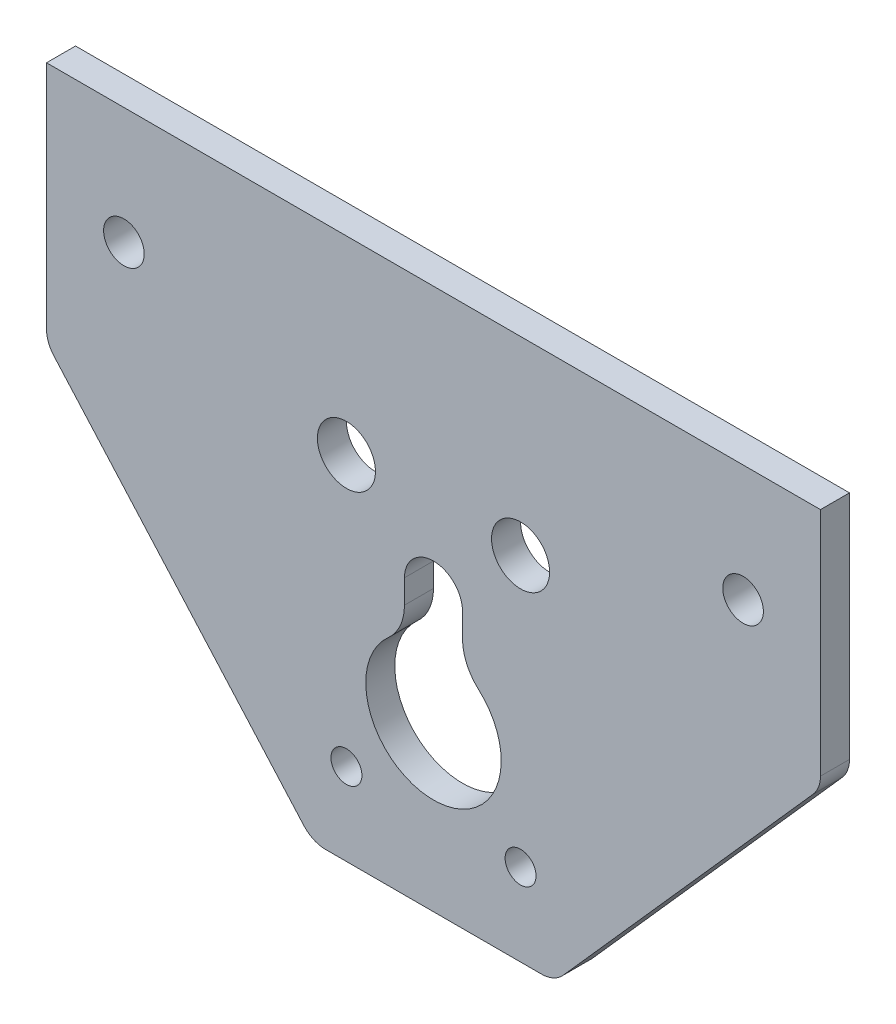
ISO-10303-21;
HEADER;
FILE_DESCRIPTION(('STEP AP214'),'2;1');
FILE_NAME('part.step','',(''),(''),'','','');
FILE_SCHEMA(('AUTOMOTIVE_DESIGN { 1 0 10303 214 1 1 1 1 }'));
ENDSEC;
DATA;
#1=APPLICATION_CONTEXT('core data for automotive mechanical design processes');
#2=APPLICATION_PROTOCOL_DEFINITION('international standard','automotive_design',2000,#1);
#3=PRODUCT_CONTEXT('',#1,'mechanical');
#4=PRODUCT('Part','Part','',(#3));
#5=PRODUCT_RELATED_PRODUCT_CATEGORY('part','',(#4));
#6=PRODUCT_DEFINITION_FORMATION('','',#4);
#7=PRODUCT_DEFINITION_CONTEXT('part definition',#1,'design');
#8=PRODUCT_DEFINITION('design','',#6,#7);
#9=PRODUCT_DEFINITION_SHAPE('','',#8);
#10=(LENGTH_UNIT() NAMED_UNIT(*) SI_UNIT(.MILLI.,.METRE.));
#11=(NAMED_UNIT(*) PLANE_ANGLE_UNIT() SI_UNIT($,.RADIAN.));
#12=(NAMED_UNIT(*) SI_UNIT($,.STERADIAN.) SOLID_ANGLE_UNIT());
#13=UNCERTAINTY_MEASURE_WITH_UNIT(LENGTH_MEASURE(1.E-05),#10,'distance_accuracy_value','');
#14=(GEOMETRIC_REPRESENTATION_CONTEXT(3) GLOBAL_UNCERTAINTY_ASSIGNED_CONTEXT((#13)) GLOBAL_UNIT_ASSIGNED_CONTEXT((#10,
#11,#12)) REPRESENTATION_CONTEXT('',''));
#15=CARTESIAN_POINT('',(0.,0.,0.));
#16=DIRECTION('',(0.,0.,1.));
#17=DIRECTION('',(1.,0.,0.));
#18=AXIS2_PLACEMENT_3D('',#15,#16,#17);
#19=CARTESIAN_POINT('',(0.,0.,3.));
#20=DIRECTION('',(0.,0.,-1.));
#21=DIRECTION('',(-1.,0.,0.));
#22=AXIS2_PLACEMENT_3D('',#19,#20,#21);
#23=PLANE('',#22);
#24=CARTESIAN_POINT('',(9.,19.4,3.));
#25=DIRECTION('',(0.,0.,1.));
#26=DIRECTION('',(1.,0.,0.));
#27=AXIS2_PLACEMENT_3D('',#24,#25,#26);
#28=CIRCLE('',#27,3.);
#29=CARTESIAN_POINT('',(12.,19.4,3.));
#30=VERTEX_POINT('',#29);
#31=EDGE_CURVE('E184',#30,#30,#28,.T.);
#32=ORIENTED_EDGE('',*,*,#31,.F.);
#33=EDGE_LOOP('',(#32));
#34=FACE_BOUND('',#33,.T.);
#35=CARTESIAN_POINT('',(-9.,19.4,3.));
#36=DIRECTION('',(0.,0.,1.));
#37=DIRECTION('',(-1.,0.,0.));
#38=AXIS2_PLACEMENT_3D('',#35,#36,#37);
#39=CIRCLE('',#38,3.);
#40=CARTESIAN_POINT('',(-12.,19.4,3.));
#41=VERTEX_POINT('',#40);
#42=EDGE_CURVE('E180',#41,#41,#39,.T.);
#43=ORIENTED_EDGE('',*,*,#42,.F.);
#44=EDGE_LOOP('',(#43));
#45=FACE_BOUND('',#44,.T.);
#46=CARTESIAN_POINT('',(31.999,26.93,3.));
#47=DIRECTION('',(0.,0.,1.));
#48=DIRECTION('',(1.,0.,0.));
#49=AXIS2_PLACEMENT_3D('',#46,#47,#48);
#50=CIRCLE('',#49,2.1);
#51=CARTESIAN_POINT('',(34.099,26.93,3.));
#52=VERTEX_POINT('',#51);
#53=EDGE_CURVE('E188',#52,#52,#50,.T.);
#54=ORIENTED_EDGE('',*,*,#53,.F.);
#55=EDGE_LOOP('',(#54));
#56=FACE_BOUND('',#55,.T.);
#57=CARTESIAN_POINT('',(-31.999,26.93,3.));
#58=DIRECTION('',(0.,0.,1.));
#59=DIRECTION('',(1.,0.,0.));
#60=AXIS2_PLACEMENT_3D('',#57,#58,#59);
#61=CIRCLE('',#60,2.1);
#62=CARTESIAN_POINT('',(-29.899,26.93,3.));
#63=VERTEX_POINT('',#62);
#64=EDGE_CURVE('E192',#63,#63,#61,.T.);
#65=ORIENTED_EDGE('',*,*,#64,.F.);
#66=EDGE_LOOP('',(#65));
#67=FACE_BOUND('',#66,.T.);
#68=DIRECTION('',(0.,-1.,0.));
#69=VECTOR('',#68,1.);
#70=CARTESIAN_POINT('',(-40.,39.,3.));
#71=LINE('',#70,#69);
#72=CARTESIAN_POINT('',(-40.,39.,3.));
#73=VERTEX_POINT('',#72);
#74=CARTESIAN_POINT('',(-40.,15.1388780272713,3.));
#75=VERTEX_POINT('',#74);
#76=EDGE_CURVE('E228',#73,#75,#71,.T.);
#77=ORIENTED_EDGE('',*,*,#76,.T.);
#78=CARTESIAN_POINT('',(-37.,15.1388780272713,3.));
#79=DIRECTION('',(0.,0.,-1.));
#80=DIRECTION('',(-1.,0.,0.));
#81=AXIS2_PLACEMENT_3D('',#78,#79,#80);
#82=CIRCLE('',#81,3.);
#83=CARTESIAN_POINT('',(-39.2442239151252,13.1480342315957,3.));
#84=VERTEX_POINT('',#83);
#85=EDGE_CURVE('E276',#75,#84,#82,.F.);
#86=ORIENTED_EDGE('',*,*,#85,.T.);
#87=DIRECTION('',(0.663614598558533,-0.748074638375074,0.));
#88=VECTOR('',#87,1.);
#89=CARTESIAN_POINT('',(-40.,14.,3.));
#90=LINE('',#89,#88);
#91=CARTESIAN_POINT('',(-13.3952192135136,-15.9908437956756,3.));
#92=VERTEX_POINT('',#91);
#93=EDGE_CURVE('E214',#84,#92,#90,.T.);
#94=ORIENTED_EDGE('',*,*,#93,.T.);
#95=CARTESIAN_POINT('',(-11.1509952983884,-14.,3.));
#96=DIRECTION('',(0.,0.,-1.));
#97=DIRECTION('',(-1.,0.,0.));
#98=AXIS2_PLACEMENT_3D('',#95,#96,#97);
#99=CIRCLE('',#98,3.);
#100=CARTESIAN_POINT('',(-11.1509952983884,-17.,3.));
#101=VERTEX_POINT('',#100);
#102=EDGE_CURVE('E274',#92,#101,#99,.F.);
#103=ORIENTED_EDGE('',*,*,#102,.T.);
#104=DIRECTION('',(1.,0.,0.));
#105=VECTOR('',#104,1.);
#106=CARTESIAN_POINT('',(-12.5,-17.,3.));
#107=LINE('',#106,#105);
#108=CARTESIAN_POINT('',(11.1509952983884,-17.,3.));
#109=VERTEX_POINT('',#108);
#110=EDGE_CURVE('E217',#101,#109,#107,.T.);
#111=ORIENTED_EDGE('',*,*,#110,.T.);
#112=CARTESIAN_POINT('',(11.1509952983884,-14.,3.));
#113=DIRECTION('',(0.,0.,-1.));
#114=DIRECTION('',(-1.,0.,0.));
#115=AXIS2_PLACEMENT_3D('',#112,#113,#114);
#116=CIRCLE('',#115,3.);
#117=CARTESIAN_POINT('',(13.3952192135136,-15.9908437956756,3.));
#118=VERTEX_POINT('',#117);
#119=EDGE_CURVE('E272',#109,#118,#116,.F.);
#120=ORIENTED_EDGE('',*,*,#119,.T.);
#121=DIRECTION('',(0.663614598558533,0.748074638375074,0.));
#122=VECTOR('',#121,1.);
#123=CARTESIAN_POINT('',(40.,14.,3.));
#124=LINE('',#123,#122);
#125=CARTESIAN_POINT('',(39.2442239151252,13.1480342315957,3.));
#126=VERTEX_POINT('',#125);
#127=EDGE_CURVE('E221',#118,#126,#124,.T.);
#128=ORIENTED_EDGE('',*,*,#127,.T.);
#129=CARTESIAN_POINT('',(37.,15.1388780272713,3.));
#130=DIRECTION('',(0.,0.,-1.));
#131=DIRECTION('',(-1.,0.,0.));
#132=AXIS2_PLACEMENT_3D('',#129,#130,#131);
#133=CIRCLE('',#132,3.);
#134=CARTESIAN_POINT('',(40.,15.1388780272713,3.));
#135=VERTEX_POINT('',#134);
#136=EDGE_CURVE('E270',#126,#135,#133,.F.);
#137=ORIENTED_EDGE('',*,*,#136,.T.);
#138=DIRECTION('',(0.,1.,0.));
#139=VECTOR('',#138,1.);
#140=CARTESIAN_POINT('',(40.,39.,3.));
#141=LINE('',#140,#139);
#142=CARTESIAN_POINT('',(40.,39.,3.));
#143=VERTEX_POINT('',#142);
#144=EDGE_CURVE('E224',#135,#143,#141,.T.);
#145=ORIENTED_EDGE('',*,*,#144,.T.);
#146=DIRECTION('',(-1.,0.,0.));
#147=VECTOR('',#146,1.);
#148=CARTESIAN_POINT('',(-40.,39.,3.));
#149=LINE('',#148,#147);
#150=EDGE_CURVE('E226',#143,#73,#149,.T.);
#151=ORIENTED_EDGE('',*,*,#150,.T.);
#152=EDGE_LOOP('',(#77,#86,#94,#103,#111,#120,#128,#137,#145,#151));
#153=FACE_BOUND('',#152,.T.);
#154=DIRECTION('',(0.,1.,0.));
#155=VECTOR('',#154,1.);
#156=CARTESIAN_POINT('',(3.,11.4,3.));
#157=LINE('',#156,#155);
#158=CARTESIAN_POINT('',(3.,8.94427190999916,3.));
#159=VERTEX_POINT('',#158);
#160=CARTESIAN_POINT('',(3.,11.4,3.));
#161=VERTEX_POINT('',#160);
#162=EDGE_CURVE('E162',#159,#161,#157,.T.);
#163=ORIENTED_EDGE('',*,*,#162,.F.);
#164=CARTESIAN_POINT('',(8.,8.94427190999916,3.));
#165=DIRECTION('',(0.,0.,-1.));
#166=DIRECTION('',(-1.,0.,0.));
#167=AXIS2_PLACEMENT_3D('',#164,#165,#166);
#168=CIRCLE('',#167,5.);
#169=CARTESIAN_POINT('',(4.66666666666667,5.21749194749951,3.));
#170=VERTEX_POINT('',#169);
#171=EDGE_CURVE('E301',#159,#170,#168,.F.);
#172=ORIENTED_EDGE('',*,*,#171,.T.);
#173=CARTESIAN_POINT('',(0.,0.,3.));
#174=DIRECTION('',(0.,0.,1.));
#175=DIRECTION('',(1.,0.,0.));
#176=AXIS2_PLACEMENT_3D('',#173,#174,#175);
#177=CIRCLE('',#176,7.);
#178=CARTESIAN_POINT('',(-4.66666666666667,5.21749194749951,3.));
#179=VERTEX_POINT('',#178);
#180=EDGE_CURVE('E210',#179,#170,#177,.T.);
#181=ORIENTED_EDGE('',*,*,#180,.F.);
#182=CARTESIAN_POINT('',(-8.,8.94427190999916,3.));
#183=DIRECTION('',(0.,0.,-1.));
#184=DIRECTION('',(-1.,0.,0.));
#185=AXIS2_PLACEMENT_3D('',#182,#183,#184);
#186=CIRCLE('',#185,5.);
#187=CARTESIAN_POINT('',(-3.,8.94427190999916,3.));
#188=VERTEX_POINT('',#187);
#189=EDGE_CURVE('E175',#179,#188,#186,.F.);
#190=ORIENTED_EDGE('',*,*,#189,.T.);
#191=DIRECTION('',(0.,-1.,0.));
#192=VECTOR('',#191,1.);
#193=CARTESIAN_POINT('',(-3.,11.4,3.));
#194=LINE('',#193,#192);
#195=CARTESIAN_POINT('',(-3.,11.4,3.));
#196=VERTEX_POINT('',#195);
#197=EDGE_CURVE('E156',#196,#188,#194,.T.);
#198=ORIENTED_EDGE('',*,*,#197,.F.);
#199=CARTESIAN_POINT('',(0.,11.4,3.));
#200=DIRECTION('',(0.,0.,1.));
#201=DIRECTION('',(1.,0.,0.));
#202=AXIS2_PLACEMENT_3D('',#199,#200,#201);
#203=CIRCLE('',#202,3.);
#204=EDGE_CURVE('E166',#161,#196,#203,.T.);
#205=ORIENTED_EDGE('',*,*,#204,.F.);
#206=EDGE_LOOP('',(#163,#172,#181,#190,#198,#205));
#207=FACE_BOUND('',#206,.T.);
#208=CARTESIAN_POINT('',(-9.,-8.5,3.));
#209=DIRECTION('',(0.,0.,1.));
#210=DIRECTION('',(1.,0.,0.));
#211=AXIS2_PLACEMENT_3D('',#208,#209,#210);
#212=CIRCLE('',#211,1.6);
#213=CARTESIAN_POINT('',(-7.39999999999999,-8.5,3.));
#214=VERTEX_POINT('',#213);
#215=EDGE_CURVE('E204',#214,#214,#212,.T.);
#216=ORIENTED_EDGE('',*,*,#215,.F.);
#217=EDGE_LOOP('',(#216));
#218=FACE_BOUND('',#217,.T.);
#219=CARTESIAN_POINT('',(9.,-8.5,3.));
#220=DIRECTION('',(0.,0.,1.));
#221=DIRECTION('',(1.,0.,0.));
#222=AXIS2_PLACEMENT_3D('',#219,#220,#221);
#223=CIRCLE('',#222,1.6);
#224=CARTESIAN_POINT('',(10.6,-8.5,3.));
#225=VERTEX_POINT('',#224);
#226=EDGE_CURVE('E196',#225,#225,#223,.T.);
#227=ORIENTED_EDGE('',*,*,#226,.F.);
#228=EDGE_LOOP('',(#227));
#229=FACE_BOUND('',#228,.T.);
#230=ADVANCED_FACE('F37',(#34,#45,#56,#67,#153,#207,#218,#229),#23,.F.);
#231=CARTESIAN_POINT('',(0.,0.,0.));
#232=DIRECTION('',(0.,0.,-1.));
#233=DIRECTION('',(-1.,0.,0.));
#234=AXIS2_PLACEMENT_3D('',#231,#232,#233);
#235=PLANE('',#234);
#236=CARTESIAN_POINT('',(9.,19.4,0.));
#237=DIRECTION('',(0.,0.,-1.));
#238=DIRECTION('',(-1.,0.,0.));
#239=AXIS2_PLACEMENT_3D('',#236,#237,#238);
#240=CIRCLE('',#239,3.);
#241=CARTESIAN_POINT('',(6.,19.4,0.));
#242=VERTEX_POINT('',#241);
#243=EDGE_CURVE('E195',#242,#242,#240,.T.);
#244=ORIENTED_EDGE('',*,*,#243,.F.);
#245=EDGE_LOOP('',(#244));
#246=FACE_BOUND('',#245,.T.);
#247=CARTESIAN_POINT('',(-9.,19.4,0.));
#248=DIRECTION('',(0.,0.,-1.));
#249=DIRECTION('',(-1.,0.,0.));
#250=AXIS2_PLACEMENT_3D('',#247,#248,#249);
#251=CIRCLE('',#250,3.);
#252=CARTESIAN_POINT('',(-12.,19.4,0.));
#253=VERTEX_POINT('',#252);
#254=EDGE_CURVE('E187',#253,#253,#251,.T.);
#255=ORIENTED_EDGE('',*,*,#254,.F.);
#256=EDGE_LOOP('',(#255));
#257=FACE_BOUND('',#256,.T.);
#258=CARTESIAN_POINT('',(0.,0.,0.));
#259=DIRECTION('',(0.,0.,1.));
#260=DIRECTION('',(1.,0.,0.));
#261=AXIS2_PLACEMENT_3D('',#258,#259,#260);
#262=CIRCLE('',#261,7.);
#263=CARTESIAN_POINT('',(-4.66666666666667,5.21749194749951,0.));
#264=VERTEX_POINT('',#263);
#265=CARTESIAN_POINT('',(4.66666666666667,5.21749194749951,0.));
#266=VERTEX_POINT('',#265);
#267=EDGE_CURVE('E207',#264,#266,#262,.T.);
#268=ORIENTED_EDGE('',*,*,#267,.T.);
#269=CARTESIAN_POINT('',(8.,8.94427190999916,0.));
#270=DIRECTION('',(0.,0.,-1.));
#271=DIRECTION('',(-1.,0.,0.));
#272=AXIS2_PLACEMENT_3D('',#269,#270,#271);
#273=CIRCLE('',#272,5.);
#274=CARTESIAN_POINT('',(3.,8.94427190999916,0.));
#275=VERTEX_POINT('',#274);
#276=EDGE_CURVE('E45',#266,#275,#273,.T.);
#277=ORIENTED_EDGE('',*,*,#276,.T.);
#278=DIRECTION('',(0.,-1.,0.));
#279=VECTOR('',#278,1.);
#280=CARTESIAN_POINT('',(3.,0.,0.));
#281=LINE('',#280,#279);
#282=CARTESIAN_POINT('',(3.,11.4,0.));
#283=VERTEX_POINT('',#282);
#284=EDGE_CURVE('E183',#283,#275,#281,.T.);
#285=ORIENTED_EDGE('',*,*,#284,.F.);
#286=CARTESIAN_POINT('',(0.,11.4,0.));
#287=DIRECTION('',(0.,0.,-1.));
#288=DIRECTION('',(-1.,0.,0.));
#289=AXIS2_PLACEMENT_3D('',#286,#287,#288);
#290=CIRCLE('',#289,3.);
#291=CARTESIAN_POINT('',(-3.,11.4,0.));
#292=VERTEX_POINT('',#291);
#293=EDGE_CURVE('E291',#292,#283,#290,.T.);
#294=ORIENTED_EDGE('',*,*,#293,.F.);
#295=DIRECTION('',(0.,1.,0.));
#296=VECTOR('',#295,1.);
#297=CARTESIAN_POINT('',(-3.,0.,0.));
#298=LINE('',#297,#296);
#299=CARTESIAN_POINT('',(-3.,8.94427190999916,0.));
#300=VERTEX_POINT('',#299);
#301=EDGE_CURVE('E158',#300,#292,#298,.T.);
#302=ORIENTED_EDGE('',*,*,#301,.F.);
#303=CARTESIAN_POINT('',(-8.,8.94427190999916,0.));
#304=DIRECTION('',(0.,0.,-1.));
#305=DIRECTION('',(-1.,0.,0.));
#306=AXIS2_PLACEMENT_3D('',#303,#304,#305);
#307=CIRCLE('',#306,5.);
#308=EDGE_CURVE('E52',#300,#264,#307,.T.);
#309=ORIENTED_EDGE('',*,*,#308,.T.);
#310=EDGE_LOOP('',(#268,#277,#285,#294,#302,#309));
#311=FACE_BOUND('',#310,.T.);
#312=CARTESIAN_POINT('',(31.999,26.93,0.));
#313=DIRECTION('',(0.,0.,-1.));
#314=DIRECTION('',(-1.,0.,0.));
#315=AXIS2_PLACEMENT_3D('',#312,#313,#314);
#316=CIRCLE('',#315,2.1);
#317=CARTESIAN_POINT('',(29.899,26.93,0.));
#318=VERTEX_POINT('',#317);
#319=EDGE_CURVE('E203',#318,#318,#316,.T.);
#320=ORIENTED_EDGE('',*,*,#319,.F.);
#321=EDGE_LOOP('',(#320));
#322=FACE_BOUND('',#321,.T.);
#323=CARTESIAN_POINT('',(-31.999,26.93,0.));
#324=DIRECTION('',(0.,0.,-1.));
#325=DIRECTION('',(-1.,0.,0.));
#326=AXIS2_PLACEMENT_3D('',#323,#324,#325);
#327=CIRCLE('',#326,2.1);
#328=CARTESIAN_POINT('',(-34.099,26.93,0.));
#329=VERTEX_POINT('',#328);
#330=EDGE_CURVE('E191',#329,#329,#327,.T.);
#331=ORIENTED_EDGE('',*,*,#330,.F.);
#332=EDGE_LOOP('',(#331));
#333=FACE_BOUND('',#332,.T.);
#334=CARTESIAN_POINT('',(-9.,-8.5,0.));
#335=DIRECTION('',(0.,0.,1.));
#336=DIRECTION('',(1.,0.,0.));
#337=AXIS2_PLACEMENT_3D('',#334,#335,#336);
#338=CIRCLE('',#337,1.6);
#339=CARTESIAN_POINT('',(-7.39999999999999,-8.5,0.));
#340=VERTEX_POINT('',#339);
#341=EDGE_CURVE('E199',#340,#340,#338,.T.);
#342=ORIENTED_EDGE('',*,*,#341,.T.);
#343=EDGE_LOOP('',(#342));
#344=FACE_BOUND('',#343,.T.);
#345=DIRECTION('',(0.663614598558533,-0.748074638375074,0.));
#346=VECTOR('',#345,1.);
#347=CARTESIAN_POINT('',(-40.,14.,0.));
#348=LINE('',#347,#346);
#349=CARTESIAN_POINT('',(-39.2442239151252,13.1480342315957,0.));
#350=VERTEX_POINT('',#349);
#351=CARTESIAN_POINT('',(-13.3952192135136,-15.9908437956756,0.));
#352=VERTEX_POINT('',#351);
#353=EDGE_CURVE('E212',#350,#352,#348,.T.);
#354=ORIENTED_EDGE('',*,*,#353,.F.);
#355=CARTESIAN_POINT('',(-37.,15.1388780272713,0.));
#356=DIRECTION('',(0.,0.,-1.));
#357=DIRECTION('',(-1.,0.,0.));
#358=AXIS2_PLACEMENT_3D('',#355,#356,#357);
#359=CIRCLE('',#358,3.);
#360=CARTESIAN_POINT('',(-40.,15.1388780272713,0.));
#361=VERTEX_POINT('',#360);
#362=EDGE_CURVE('E266',#350,#361,#359,.T.);
#363=ORIENTED_EDGE('',*,*,#362,.T.);
#364=DIRECTION('',(0.,-1.,0.));
#365=VECTOR('',#364,1.);
#366=CARTESIAN_POINT('',(-40.,39.,0.));
#367=LINE('',#366,#365);
#368=CARTESIAN_POINT('',(-40.,39.,0.));
#369=VERTEX_POINT('',#368);
#370=EDGE_CURVE('E218',#369,#361,#367,.T.);
#371=ORIENTED_EDGE('',*,*,#370,.F.);
#372=DIRECTION('',(-1.,0.,0.));
#373=VECTOR('',#372,1.);
#374=CARTESIAN_POINT('',(-40.,39.,0.));
#375=LINE('',#374,#373);
#376=CARTESIAN_POINT('',(40.,39.,0.));
#377=VERTEX_POINT('',#376);
#378=EDGE_CURVE('E242',#377,#369,#375,.T.);
#379=ORIENTED_EDGE('',*,*,#378,.F.);
#380=DIRECTION('',(0.,1.,0.));
#381=VECTOR('',#380,1.);
#382=CARTESIAN_POINT('',(40.,39.,0.));
#383=LINE('',#382,#381);
#384=CARTESIAN_POINT('',(40.,15.1388780272713,0.));
#385=VERTEX_POINT('',#384);
#386=EDGE_CURVE('E240',#385,#377,#383,.T.);
#387=ORIENTED_EDGE('',*,*,#386,.F.);
#388=CARTESIAN_POINT('',(37.,15.1388780272713,0.));
#389=DIRECTION('',(0.,0.,-1.));
#390=DIRECTION('',(-1.,0.,0.));
#391=AXIS2_PLACEMENT_3D('',#388,#389,#390);
#392=CIRCLE('',#391,3.);
#393=CARTESIAN_POINT('',(39.2442239151252,13.1480342315957,0.));
#394=VERTEX_POINT('',#393);
#395=EDGE_CURVE('E260',#385,#394,#392,.T.);
#396=ORIENTED_EDGE('',*,*,#395,.T.);
#397=DIRECTION('',(0.663614598558533,0.748074638375074,0.));
#398=VECTOR('',#397,1.);
#399=CARTESIAN_POINT('',(40.,14.,0.));
#400=LINE('',#399,#398);
#401=CARTESIAN_POINT('',(13.3952192135136,-15.9908437956756,0.));
#402=VERTEX_POINT('',#401);
#403=EDGE_CURVE('E237',#402,#394,#400,.T.);
#404=ORIENTED_EDGE('',*,*,#403,.F.);
#405=CARTESIAN_POINT('',(11.1509952983884,-14.,0.));
#406=DIRECTION('',(0.,0.,-1.));
#407=DIRECTION('',(-1.,0.,0.));
#408=AXIS2_PLACEMENT_3D('',#405,#406,#407);
#409=CIRCLE('',#408,3.);
#410=CARTESIAN_POINT('',(11.1509952983884,-17.,0.));
#411=VERTEX_POINT('',#410);
#412=EDGE_CURVE('E262',#402,#411,#409,.T.);
#413=ORIENTED_EDGE('',*,*,#412,.T.);
#414=DIRECTION('',(1.,0.,0.));
#415=VECTOR('',#414,1.);
#416=CARTESIAN_POINT('',(-12.5,-17.,0.));
#417=LINE('',#416,#415);
#418=CARTESIAN_POINT('',(-11.1509952983884,-17.,0.));
#419=VERTEX_POINT('',#418);
#420=EDGE_CURVE('E234',#419,#411,#417,.T.);
#421=ORIENTED_EDGE('',*,*,#420,.F.);
#422=CARTESIAN_POINT('',(-11.1509952983884,-14.,0.));
#423=DIRECTION('',(0.,0.,-1.));
#424=DIRECTION('',(-1.,0.,0.));
#425=AXIS2_PLACEMENT_3D('',#422,#423,#424);
#426=CIRCLE('',#425,3.);
#427=EDGE_CURVE('E264',#419,#352,#426,.T.);
#428=ORIENTED_EDGE('',*,*,#427,.T.);
#429=EDGE_LOOP('',(#354,#363,#371,#379,#387,#396,#404,#413,#421,#428));
#430=FACE_BOUND('',#429,.T.);
#431=CARTESIAN_POINT('',(9.,-8.5,0.));
#432=DIRECTION('',(0.,0.,1.));
#433=DIRECTION('',(1.,0.,0.));
#434=AXIS2_PLACEMENT_3D('',#431,#432,#433);
#435=CIRCLE('',#434,1.6);
#436=CARTESIAN_POINT('',(10.6,-8.5,0.));
#437=VERTEX_POINT('',#436);
#438=EDGE_CURVE('E200',#437,#437,#435,.T.);
#439=ORIENTED_EDGE('',*,*,#438,.T.);
#440=EDGE_LOOP('',(#439));
#441=FACE_BOUND('',#440,.T.);
#442=ADVANCED_FACE('F309',(#246,#257,#311,#322,#333,#344,#430,#441),#235,.T.);
#443=CARTESIAN_POINT('',(-40.,14.,3.));
#444=DIRECTION('',(0.748074638375073,0.663614598558533,0.));
#445=DIRECTION('',(-0.663614598558533,0.748074638375074,0.));
#446=AXIS2_PLACEMENT_3D('',#443,#444,#445);
#447=PLANE('',#446);
#448=ORIENTED_EDGE('',*,*,#93,.F.);
#449=DIRECTION('',(0.,0.,-1.));
#450=VECTOR('',#449,1.);
#451=CARTESIAN_POINT('',(-39.2442239151252,13.1480342315957,3.));
#452=LINE('',#451,#450);
#453=EDGE_CURVE('E257',#84,#350,#452,.T.);
#454=ORIENTED_EDGE('',*,*,#453,.T.);
#455=ORIENTED_EDGE('',*,*,#353,.T.);
#456=DIRECTION('',(0.,0.,-1.));
#457=VECTOR('',#456,1.);
#458=CARTESIAN_POINT('',(-13.3952192135136,-15.9908437956756,3.));
#459=LINE('',#458,#457);
#460=EDGE_CURVE('E251',#352,#92,#459,.F.);
#461=ORIENTED_EDGE('',*,*,#460,.T.);
#462=EDGE_LOOP('',(#448,#454,#455,#461));
#463=FACE_BOUND('',#462,.T.);
#464=ADVANCED_FACE('F328',(#463),#447,.F.);
#465=CARTESIAN_POINT('',(-12.5,-17.,3.));
#466=DIRECTION('',(0.,1.,0.));
#467=DIRECTION('',(-1.,0.,0.));
#468=AXIS2_PLACEMENT_3D('',#465,#466,#467);
#469=PLANE('',#468);
#470=ORIENTED_EDGE('',*,*,#110,.F.);
#471=DIRECTION('',(0.,0.,-1.));
#472=VECTOR('',#471,1.);
#473=CARTESIAN_POINT('',(-11.1509952983884,-17.,3.));
#474=LINE('',#473,#472);
#475=EDGE_CURVE('E280',#101,#419,#474,.T.);
#476=ORIENTED_EDGE('',*,*,#475,.T.);
#477=ORIENTED_EDGE('',*,*,#420,.T.);
#478=DIRECTION('',(0.,0.,-1.));
#479=VECTOR('',#478,1.);
#480=CARTESIAN_POINT('',(11.1509952983884,-17.,3.));
#481=LINE('',#480,#479);
#482=EDGE_CURVE('E278',#411,#109,#481,.F.);
#483=ORIENTED_EDGE('',*,*,#482,.T.);
#484=EDGE_LOOP('',(#470,#476,#477,#483));
#485=FACE_BOUND('',#484,.T.);
#486=ADVANCED_FACE('F351',(#485),#469,.F.);
#487=CARTESIAN_POINT('',(40.,14.,3.));
#488=DIRECTION('',(-0.748074638375074,0.663614598558533,0.));
#489=DIRECTION('',(-0.663614598558533,-0.748074638375074,0.));
#490=AXIS2_PLACEMENT_3D('',#487,#488,#489);
#491=PLANE('',#490);
#492=ORIENTED_EDGE('',*,*,#127,.F.);
#493=DIRECTION('',(0.,0.,-1.));
#494=VECTOR('',#493,1.);
#495=CARTESIAN_POINT('',(13.3952192135136,-15.9908437956756,3.));
#496=LINE('',#495,#494);
#497=EDGE_CURVE('E285',#118,#402,#496,.T.);
#498=ORIENTED_EDGE('',*,*,#497,.T.);
#499=ORIENTED_EDGE('',*,*,#403,.T.);
#500=DIRECTION('',(0.,0.,-1.));
#501=VECTOR('',#500,1.);
#502=CARTESIAN_POINT('',(39.2442239151252,13.1480342315957,3.));
#503=LINE('',#502,#501);
#504=EDGE_CURVE('E283',#394,#126,#503,.F.);
#505=ORIENTED_EDGE('',*,*,#504,.T.);
#506=EDGE_LOOP('',(#492,#498,#499,#505));
#507=FACE_BOUND('',#506,.T.);
#508=ADVANCED_FACE('F347',(#507),#491,.F.);
#509=CARTESIAN_POINT('',(40.,39.,3.));
#510=DIRECTION('',(-1.,0.,0.));
#511=DIRECTION('',(0.,0.,1.));
#512=AXIS2_PLACEMENT_3D('',#509,#510,#511);
#513=PLANE('',#512);
#514=ORIENTED_EDGE('',*,*,#144,.F.);
#515=DIRECTION('',(0.,0.,-1.));
#516=VECTOR('',#515,1.);
#517=CARTESIAN_POINT('',(40.,15.1388780272713,3.));
#518=LINE('',#517,#516);
#519=EDGE_CURVE('E288',#135,#385,#518,.T.);
#520=ORIENTED_EDGE('',*,*,#519,.T.);
#521=ORIENTED_EDGE('',*,*,#386,.T.);
#522=DIRECTION('',(0.,0.,-1.));
#523=VECTOR('',#522,1.);
#524=CARTESIAN_POINT('',(40.,39.,3.));
#525=LINE('',#524,#523);
#526=EDGE_CURVE('E248',#143,#377,#525,.T.);
#527=ORIENTED_EDGE('',*,*,#526,.F.);
#528=EDGE_LOOP('',(#514,#520,#521,#527));
#529=FACE_BOUND('',#528,.T.);
#530=ADVANCED_FACE('F343',(#529),#513,.F.);
#531=CARTESIAN_POINT('',(-40.,39.,3.));
#532=DIRECTION('',(0.,-1.,0.));
#533=DIRECTION('',(1.,0.,0.));
#534=AXIS2_PLACEMENT_3D('',#531,#532,#533);
#535=PLANE('',#534);
#536=ORIENTED_EDGE('',*,*,#378,.T.);
#537=DIRECTION('',(0.,0.,-1.));
#538=VECTOR('',#537,1.);
#539=CARTESIAN_POINT('',(-40.,39.,3.));
#540=LINE('',#539,#538);
#541=EDGE_CURVE('E231',#73,#369,#540,.T.);
#542=ORIENTED_EDGE('',*,*,#541,.F.);
#543=ORIENTED_EDGE('',*,*,#150,.F.);
#544=ORIENTED_EDGE('',*,*,#526,.T.);
#545=EDGE_LOOP('',(#536,#542,#543,#544));
#546=FACE_BOUND('',#545,.T.);
#547=ADVANCED_FACE('F339',(#546),#535,.F.);
#548=CARTESIAN_POINT('',(-40.,39.,3.));
#549=DIRECTION('',(1.,0.,0.));
#550=DIRECTION('',(0.,0.,-1.));
#551=AXIS2_PLACEMENT_3D('',#548,#549,#550);
#552=PLANE('',#551);
#553=ORIENTED_EDGE('',*,*,#370,.T.);
#554=DIRECTION('',(0.,0.,-1.));
#555=VECTOR('',#554,1.);
#556=CARTESIAN_POINT('',(-40.,15.1388780272713,3.));
#557=LINE('',#556,#555);
#558=EDGE_CURVE('E268',#361,#75,#557,.F.);
#559=ORIENTED_EDGE('',*,*,#558,.T.);
#560=ORIENTED_EDGE('',*,*,#76,.F.);
#561=ORIENTED_EDGE('',*,*,#541,.T.);
#562=EDGE_LOOP('',(#553,#559,#560,#561));
#563=FACE_BOUND('',#562,.T.);
#564=ADVANCED_FACE('F336',(#563),#552,.F.);
#565=CARTESIAN_POINT('',(0.,0.,3.));
#566=DIRECTION('',(0.,0.,-1.));
#567=DIRECTION('',(-1.,0.,0.));
#568=AXIS2_PLACEMENT_3D('',#565,#566,#567);
#569=CYLINDRICAL_SURFACE('',#568,7.);
#570=ORIENTED_EDGE('',*,*,#180,.T.);
#571=DIRECTION('',(0.,0.,-1.));
#572=VECTOR('',#571,1.);
#573=CARTESIAN_POINT('',(4.66666666666667,5.21749194749951,3.));
#574=LINE('',#573,#572);
#575=EDGE_CURVE('E59',#170,#266,#574,.T.);
#576=ORIENTED_EDGE('',*,*,#575,.T.);
#577=ORIENTED_EDGE('',*,*,#267,.F.);
#578=DIRECTION('',(0.,0.,-1.));
#579=VECTOR('',#578,1.);
#580=CARTESIAN_POINT('',(-4.66666666666667,5.21749194749951,3.));
#581=LINE('',#580,#579);
#582=EDGE_CURVE('E303',#264,#179,#581,.F.);
#583=ORIENTED_EDGE('',*,*,#582,.T.);
#584=EDGE_LOOP('',(#570,#576,#577,#583));
#585=FACE_BOUND('',#584,.T.);
#586=ADVANCED_FACE('F316',(#585),#569,.F.);
#587=CARTESIAN_POINT('',(-9.,-8.5,3.));
#588=DIRECTION('',(0.,0.,-1.));
#589=DIRECTION('',(-1.,0.,0.));
#590=AXIS2_PLACEMENT_3D('',#587,#588,#589);
#591=CYLINDRICAL_SURFACE('',#590,1.6);
#592=ORIENTED_EDGE('',*,*,#215,.T.);
#593=EDGE_LOOP('',(#592));
#594=FACE_BOUND('',#593,.T.);
#595=ORIENTED_EDGE('',*,*,#341,.F.);
#596=EDGE_LOOP('',(#595));
#597=FACE_BOUND('',#596,.T.);
#598=ADVANCED_FACE('F413',(#594,#597),#591,.F.);
#599=CARTESIAN_POINT('',(9.,-8.5,3.));
#600=DIRECTION('',(0.,0.,-1.));
#601=DIRECTION('',(-1.,0.,0.));
#602=AXIS2_PLACEMENT_3D('',#599,#600,#601);
#603=CYLINDRICAL_SURFACE('',#602,1.6);
#604=ORIENTED_EDGE('',*,*,#226,.T.);
#605=EDGE_LOOP('',(#604));
#606=FACE_BOUND('',#605,.T.);
#607=ORIENTED_EDGE('',*,*,#438,.F.);
#608=EDGE_LOOP('',(#607));
#609=FACE_BOUND('',#608,.T.);
#610=ADVANCED_FACE('F410',(#606,#609),#603,.F.);
#611=CARTESIAN_POINT('',(-31.999,26.93,-7.));
#612=DIRECTION('',(0.,0.,1.));
#613=DIRECTION('',(1.,0.,0.));
#614=AXIS2_PLACEMENT_3D('',#611,#612,#613);
#615=CYLINDRICAL_SURFACE('',#614,2.1);
#616=ORIENTED_EDGE('',*,*,#330,.T.);
#617=EDGE_LOOP('',(#616));
#618=FACE_BOUND('',#617,.T.);
#619=ORIENTED_EDGE('',*,*,#64,.T.);
#620=EDGE_LOOP('',(#619));
#621=FACE_BOUND('',#620,.T.);
#622=ADVANCED_FACE('F412',(#618,#621),#615,.F.);
#623=CARTESIAN_POINT('',(31.999,26.93,-7.));
#624=DIRECTION('',(0.,0.,1.));
#625=DIRECTION('',(1.,0.,0.));
#626=AXIS2_PLACEMENT_3D('',#623,#624,#625);
#627=CYLINDRICAL_SURFACE('',#626,2.1);
#628=ORIENTED_EDGE('',*,*,#319,.T.);
#629=EDGE_LOOP('',(#628));
#630=FACE_BOUND('',#629,.T.);
#631=ORIENTED_EDGE('',*,*,#53,.T.);
#632=EDGE_LOOP('',(#631));
#633=FACE_BOUND('',#632,.T.);
#634=ADVANCED_FACE('F363',(#630,#633),#627,.F.);
#635=CARTESIAN_POINT('',(-37.,15.1388780272713,3.));
#636=DIRECTION('',(0.,0.,-1.));
#637=DIRECTION('',(-1.,0.,0.));
#638=AXIS2_PLACEMENT_3D('',#635,#636,#637);
#639=CYLINDRICAL_SURFACE('',#638,3.);
#640=ORIENTED_EDGE('',*,*,#85,.F.);
#641=ORIENTED_EDGE('',*,*,#558,.F.);
#642=ORIENTED_EDGE('',*,*,#362,.F.);
#643=ORIENTED_EDGE('',*,*,#453,.F.);
#644=EDGE_LOOP('',(#640,#641,#642,#643));
#645=FACE_BOUND('',#644,.T.);
#646=ADVANCED_FACE('F359',(#645),#639,.T.);
#647=CARTESIAN_POINT('',(-11.1509952983884,-14.,3.));
#648=DIRECTION('',(0.,0.,-1.));
#649=DIRECTION('',(-1.,0.,0.));
#650=AXIS2_PLACEMENT_3D('',#647,#648,#649);
#651=CYLINDRICAL_SURFACE('',#650,3.);
#652=ORIENTED_EDGE('',*,*,#102,.F.);
#653=ORIENTED_EDGE('',*,*,#460,.F.);
#654=ORIENTED_EDGE('',*,*,#427,.F.);
#655=ORIENTED_EDGE('',*,*,#475,.F.);
#656=EDGE_LOOP('',(#652,#653,#654,#655));
#657=FACE_BOUND('',#656,.T.);
#658=ADVANCED_FACE('F362',(#657),#651,.T.);
#659=CARTESIAN_POINT('',(11.1509952983884,-14.,3.));
#660=DIRECTION('',(0.,0.,-1.));
#661=DIRECTION('',(-1.,0.,0.));
#662=AXIS2_PLACEMENT_3D('',#659,#660,#661);
#663=CYLINDRICAL_SURFACE('',#662,3.);
#664=ORIENTED_EDGE('',*,*,#119,.F.);
#665=ORIENTED_EDGE('',*,*,#482,.F.);
#666=ORIENTED_EDGE('',*,*,#412,.F.);
#667=ORIENTED_EDGE('',*,*,#497,.F.);
#668=EDGE_LOOP('',(#664,#665,#666,#667));
#669=FACE_BOUND('',#668,.T.);
#670=ADVANCED_FACE('F367',(#669),#663,.T.);
#671=CARTESIAN_POINT('',(37.,15.1388780272713,3.));
#672=DIRECTION('',(0.,0.,-1.));
#673=DIRECTION('',(-1.,0.,0.));
#674=AXIS2_PLACEMENT_3D('',#671,#672,#673);
#675=CYLINDRICAL_SURFACE('',#674,3.);
#676=ORIENTED_EDGE('',*,*,#136,.F.);
#677=ORIENTED_EDGE('',*,*,#504,.F.);
#678=ORIENTED_EDGE('',*,*,#395,.F.);
#679=ORIENTED_EDGE('',*,*,#519,.F.);
#680=EDGE_LOOP('',(#676,#677,#678,#679));
#681=FACE_BOUND('',#680,.T.);
#682=ADVANCED_FACE('F371',(#681),#675,.T.);
#683=CARTESIAN_POINT('',(0.,11.4,-7.));
#684=DIRECTION('',(0.,0.,1.));
#685=DIRECTION('',(1.,0.,0.));
#686=AXIS2_PLACEMENT_3D('',#683,#684,#685);
#687=CYLINDRICAL_SURFACE('',#686,3.);
#688=ORIENTED_EDGE('',*,*,#293,.T.);
#689=DIRECTION('',(0.,0.,1.));
#690=VECTOR('',#689,1.);
#691=CARTESIAN_POINT('',(3.,11.4,-7.));
#692=LINE('',#691,#690);
#693=EDGE_CURVE('E161',#283,#161,#692,.T.);
#694=ORIENTED_EDGE('',*,*,#693,.T.);
#695=ORIENTED_EDGE('',*,*,#204,.T.);
#696=DIRECTION('',(0.,0.,1.));
#697=VECTOR('',#696,1.);
#698=CARTESIAN_POINT('',(-3.,11.4,-7.));
#699=LINE('',#698,#697);
#700=EDGE_CURVE('E152',#292,#196,#699,.T.);
#701=ORIENTED_EDGE('',*,*,#700,.F.);
#702=EDGE_LOOP('',(#688,#694,#695,#701));
#703=FACE_BOUND('',#702,.T.);
#704=ADVANCED_FACE('F167',(#703),#687,.F.);
#705=CARTESIAN_POINT('',(3.,11.4,-7.));
#706=DIRECTION('',(1.,0.,0.));
#707=DIRECTION('',(0.,0.,-1.));
#708=AXIS2_PLACEMENT_3D('',#705,#706,#707);
#709=PLANE('',#708);
#710=ORIENTED_EDGE('',*,*,#284,.T.);
#711=DIRECTION('',(0.,0.,1.));
#712=VECTOR('',#711,1.);
#713=CARTESIAN_POINT('',(3.,8.94427190999916,3.));
#714=LINE('',#713,#712);
#715=EDGE_CURVE('E293',#275,#159,#714,.T.);
#716=ORIENTED_EDGE('',*,*,#715,.T.);
#717=ORIENTED_EDGE('',*,*,#162,.T.);
#718=ORIENTED_EDGE('',*,*,#693,.F.);
#719=EDGE_LOOP('',(#710,#716,#717,#718));
#720=FACE_BOUND('',#719,.T.);
#721=ADVANCED_FACE('F314',(#720),#709,.F.);
#722=CARTESIAN_POINT('',(-3.,11.4,-7.));
#723=DIRECTION('',(-1.,0.,0.));
#724=DIRECTION('',(0.,0.,1.));
#725=AXIS2_PLACEMENT_3D('',#722,#723,#724);
#726=PLANE('',#725);
#727=ORIENTED_EDGE('',*,*,#197,.T.);
#728=DIRECTION('',(0.,0.,1.));
#729=VECTOR('',#728,1.);
#730=CARTESIAN_POINT('',(-3.,8.94427190999916,0.));
#731=LINE('',#730,#729);
#732=EDGE_CURVE('E11',#188,#300,#731,.F.);
#733=ORIENTED_EDGE('',*,*,#732,.T.);
#734=ORIENTED_EDGE('',*,*,#301,.T.);
#735=ORIENTED_EDGE('',*,*,#700,.T.);
#736=EDGE_LOOP('',(#727,#733,#734,#735));
#737=FACE_BOUND('',#736,.T.);
#738=ADVANCED_FACE('F154',(#737),#726,.F.);
#739=CARTESIAN_POINT('',(-9.,19.4,-7.));
#740=DIRECTION('',(0.,0.,1.));
#741=DIRECTION('',(1.,0.,0.));
#742=AXIS2_PLACEMENT_3D('',#739,#740,#741);
#743=CYLINDRICAL_SURFACE('',#742,3.);
#744=ORIENTED_EDGE('',*,*,#254,.T.);
#745=EDGE_LOOP('',(#744));
#746=FACE_BOUND('',#745,.T.);
#747=ORIENTED_EDGE('',*,*,#42,.T.);
#748=EDGE_LOOP('',(#747));
#749=FACE_BOUND('',#748,.T.);
#750=ADVANCED_FACE('F429',(#746,#749),#743,.F.);
#751=CARTESIAN_POINT('',(9.,19.4,-7.));
#752=DIRECTION('',(0.,0.,1.));
#753=DIRECTION('',(1.,0.,0.));
#754=AXIS2_PLACEMENT_3D('',#751,#752,#753);
#755=CYLINDRICAL_SURFACE('',#754,3.);
#756=ORIENTED_EDGE('',*,*,#243,.T.);
#757=EDGE_LOOP('',(#756));
#758=FACE_BOUND('',#757,.T.);
#759=ORIENTED_EDGE('',*,*,#31,.T.);
#760=EDGE_LOOP('',(#759));
#761=FACE_BOUND('',#760,.T.);
#762=ADVANCED_FACE('F321',(#758,#761),#755,.F.);
#763=CARTESIAN_POINT('',(8.,8.94427190999916,3.));
#764=DIRECTION('',(0.,0.,-1.));
#765=DIRECTION('',(-1.,0.,0.));
#766=AXIS2_PLACEMENT_3D('',#763,#764,#765);
#767=CYLINDRICAL_SURFACE('',#766,5.);
#768=ORIENTED_EDGE('',*,*,#276,.F.);
#769=ORIENTED_EDGE('',*,*,#575,.F.);
#770=ORIENTED_EDGE('',*,*,#171,.F.);
#771=ORIENTED_EDGE('',*,*,#715,.F.);
#772=EDGE_LOOP('',(#768,#769,#770,#771));
#773=FACE_BOUND('',#772,.T.);
#774=ADVANCED_FACE('F315',(#773),#767,.T.);
#775=CARTESIAN_POINT('',(-8.,8.94427190999916,3.));
#776=DIRECTION('',(0.,0.,-1.));
#777=DIRECTION('',(-1.,0.,0.));
#778=AXIS2_PLACEMENT_3D('',#775,#776,#777);
#779=CYLINDRICAL_SURFACE('',#778,5.);
#780=ORIENTED_EDGE('',*,*,#189,.F.);
#781=ORIENTED_EDGE('',*,*,#582,.F.);
#782=ORIENTED_EDGE('',*,*,#308,.F.);
#783=ORIENTED_EDGE('',*,*,#732,.F.);
#784=EDGE_LOOP('',(#780,#781,#782,#783));
#785=FACE_BOUND('',#784,.T.);
#786=ADVANCED_FACE('F39',(#785),#779,.T.);
#787=CLOSED_SHELL('',(#230,#442,#464,#486,#508,#530,#547,#564,#586,#598,#610,#622,#634,#646,
#658,#670,#682,#704,#721,#738,#750,#762,#774,#786));
#788=MANIFOLD_SOLID_BREP('B2',#787);
#789=ADVANCED_BREP_SHAPE_REPRESENTATION('',(#18,#788),#14);
#790=SHAPE_DEFINITION_REPRESENTATION(#9,#789);
ENDSEC;
END-ISO-10303-21;
